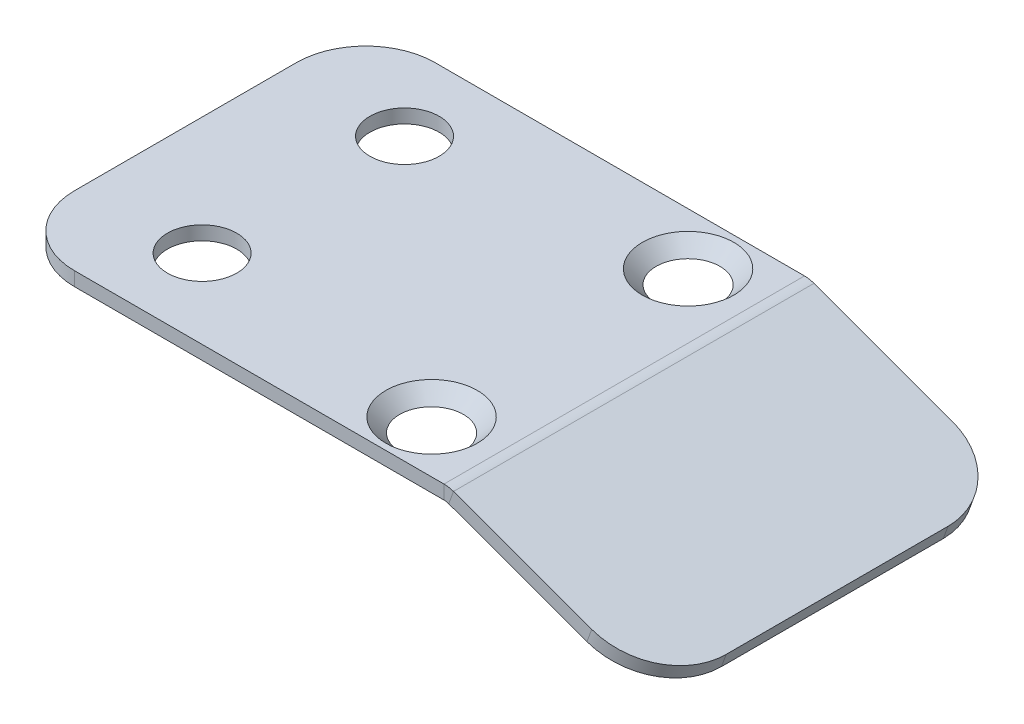
ISO-10303-21;
HEADER;
FILE_DESCRIPTION(('STEP AP214'),'2;1');
FILE_NAME('part.step','',(''),(''),'','','');
FILE_SCHEMA(('AUTOMOTIVE_DESIGN { 1 0 10303 214 1 1 1 1 }'));
ENDSEC;
DATA;
#1=APPLICATION_CONTEXT('core data for automotive mechanical design processes');
#2=APPLICATION_PROTOCOL_DEFINITION('international standard','automotive_design',2000,#1);
#3=PRODUCT_CONTEXT('',#1,'mechanical');
#4=PRODUCT('Part','Part','',(#3));
#5=PRODUCT_RELATED_PRODUCT_CATEGORY('part','',(#4));
#6=PRODUCT_DEFINITION_FORMATION('','',#4);
#7=PRODUCT_DEFINITION_CONTEXT('part definition',#1,'design');
#8=PRODUCT_DEFINITION('design','',#6,#7);
#9=PRODUCT_DEFINITION_SHAPE('','',#8);
#10=(LENGTH_UNIT() NAMED_UNIT(*) SI_UNIT(.MILLI.,.METRE.));
#11=(NAMED_UNIT(*) PLANE_ANGLE_UNIT() SI_UNIT($,.RADIAN.));
#12=(NAMED_UNIT(*) SI_UNIT($,.STERADIAN.) SOLID_ANGLE_UNIT());
#13=UNCERTAINTY_MEASURE_WITH_UNIT(LENGTH_MEASURE(1.E-05),#10,'distance_accuracy_value','');
#14=(GEOMETRIC_REPRESENTATION_CONTEXT(3) GLOBAL_UNCERTAINTY_ASSIGNED_CONTEXT((#13)) GLOBAL_UNIT_ASSIGNED_CONTEXT((#10,
#11,#12)) REPRESENTATION_CONTEXT('',''));
#15=CARTESIAN_POINT('',(0.,0.,0.));
#16=DIRECTION('',(0.,0.,1.));
#17=DIRECTION('',(1.,0.,0.));
#18=AXIS2_PLACEMENT_3D('',#15,#16,#17);
#19=CARTESIAN_POINT('',(16.3313863252344,-0.120614758428185,13.));
#20=DIRECTION('',(0.,0.,1.));
#21=DIRECTION('',(1.,0.,0.));
#22=AXIS2_PLACEMENT_3D('',#19,#20,#21);
#23=PLANE('',#22);
#24=DIRECTION('',(-0.342020143325669,-0.939692620785908,0.));
#25=VECTOR('',#24,1.);
#26=CARTESIAN_POINT('',(16.3313863252344,-0.120614758428185,13.));
#27=LINE('',#26,#25);
#28=CARTESIAN_POINT('',(16.3313863252344,-0.120614758428185,13.));
#29=VERTEX_POINT('',#28);
#30=CARTESIAN_POINT('',(15.9893661819087,-1.06030737921409,13.));
#31=VERTEX_POINT('',#30);
#32=EDGE_CURVE('E129',#29,#31,#27,.T.);
#33=ORIENTED_EDGE('',*,*,#32,.F.);
#34=CARTESIAN_POINT('',(15.6473460385831,-2.,13.));
#35=DIRECTION('',(0.,0.,1.));
#36=DIRECTION('',(1.,0.,0.));
#37=AXIS2_PLACEMENT_3D('',#34,#35,#36);
#38=CIRCLE('',#37,2.);
#39=CARTESIAN_POINT('',(15.6473460385831,0.,13.));
#40=VERTEX_POINT('',#39);
#41=EDGE_CURVE('E133',#40,#29,#38,.F.);
#42=ORIENTED_EDGE('',*,*,#41,.F.);
#43=DIRECTION('',(0.,1.,0.));
#44=VECTOR('',#43,1.);
#45=CARTESIAN_POINT('',(15.6473460385831,-1.,13.));
#46=LINE('',#45,#44);
#47=CARTESIAN_POINT('',(15.6473460385831,-1.,13.));
#48=VERTEX_POINT('',#47);
#49=EDGE_CURVE('E138',#48,#40,#46,.T.);
#50=ORIENTED_EDGE('',*,*,#49,.F.);
#51=CARTESIAN_POINT('',(15.6473460385831,-2.,13.));
#52=DIRECTION('',(0.,0.,1.));
#53=DIRECTION('',(1.,0.,0.));
#54=AXIS2_PLACEMENT_3D('',#51,#52,#53);
#55=CIRCLE('',#54,1.);
#56=EDGE_CURVE('E135',#48,#31,#55,.F.);
#57=ORIENTED_EDGE('',*,*,#56,.T.);
#58=EDGE_LOOP('',(#33,#42,#50,#57));
#59=FACE_BOUND('',#58,.T.);
#60=ADVANCED_FACE('F38',(#59),#23,.T.);
#61=CARTESIAN_POINT('',(15.6473460385831,-1.,13.));
#62=DIRECTION('',(0.,0.,1.));
#63=DIRECTION('',(1.,0.,0.));
#64=AXIS2_PLACEMENT_3D('',#61,#62,#63);
#65=PLANE('',#64);
#66=DIRECTION('',(0.939692620785908,-0.342020143325669,0.));
#67=VECTOR('',#66,1.);
#68=CARTESIAN_POINT('',(15.6579798566743,-0.939692620785908,13.));
#69=LINE('',#68,#67);
#70=CARTESIAN_POINT('',(25.9595167527448,-4.68914541815061,13.));
#71=VERTEX_POINT('',#70);
#72=EDGE_CURVE('E156',#31,#71,#69,.T.);
#73=ORIENTED_EDGE('',*,*,#72,.T.);
#74=DIRECTION('',(-0.342020143325665,-0.93969262078591,0.));
#75=VECTOR('',#74,1.);
#76=CARTESIAN_POINT('',(25.9388904142624,-4.74581581737699,13.));
#77=LINE('',#76,#75);
#78=CARTESIAN_POINT('',(26.3015368960705,-3.7494527973647,13.));
#79=VERTEX_POINT('',#78);
#80=EDGE_CURVE('E11',#71,#79,#77,.F.);
#81=ORIENTED_EDGE('',*,*,#80,.T.);
#82=DIRECTION('',(0.939692620785908,-0.342020143325669,0.));
#83=VECTOR('',#82,1.);
#84=CARTESIAN_POINT('',(16.,0.,13.));
#85=LINE('',#84,#83);
#86=EDGE_CURVE('E145',#29,#79,#85,.T.);
#87=ORIENTED_EDGE('',*,*,#86,.F.);
#88=ORIENTED_EDGE('',*,*,#32,.T.);
#89=EDGE_LOOP('',(#73,#81,#87,#88));
#90=FACE_BOUND('',#89,.T.);
#91=ADVANCED_FACE('F155',(#90),#65,.T.);
#92=CARTESIAN_POINT('',(15.6473460385831,0.,-13.));
#93=DIRECTION('',(0.,0.,-1.));
#94=DIRECTION('',(-1.,0.,0.));
#95=AXIS2_PLACEMENT_3D('',#92,#93,#94);
#96=PLANE('',#95);
#97=DIRECTION('',(0.,-1.,0.));
#98=VECTOR('',#97,1.);
#99=CARTESIAN_POINT('',(15.6473460385831,0.,-13.));
#100=LINE('',#99,#98);
#101=CARTESIAN_POINT('',(15.6473460385831,0.,-13.));
#102=VERTEX_POINT('',#101);
#103=CARTESIAN_POINT('',(15.6473460385831,-1.,-13.));
#104=VERTEX_POINT('',#103);
#105=EDGE_CURVE('E201',#102,#104,#100,.T.);
#106=ORIENTED_EDGE('',*,*,#105,.F.);
#107=CARTESIAN_POINT('',(15.6473460385831,-2.,-13.));
#108=DIRECTION('',(0.,0.,1.));
#109=DIRECTION('',(1.,0.,0.));
#110=AXIS2_PLACEMENT_3D('',#107,#108,#109);
#111=CIRCLE('',#110,2.);
#112=CARTESIAN_POINT('',(16.3313863252344,-0.120614758428185,-13.));
#113=VERTEX_POINT('',#112);
#114=EDGE_CURVE('E175',#102,#113,#111,.F.);
#115=ORIENTED_EDGE('',*,*,#114,.T.);
#116=DIRECTION('',(0.342020143325669,0.939692620785908,0.));
#117=VECTOR('',#116,1.);
#118=CARTESIAN_POINT('',(15.9893661819087,-1.06030737921409,-13.));
#119=LINE('',#118,#117);
#120=CARTESIAN_POINT('',(15.9893661819087,-1.06030737921409,-13.));
#121=VERTEX_POINT('',#120);
#122=EDGE_CURVE('E199',#121,#113,#119,.T.);
#123=ORIENTED_EDGE('',*,*,#122,.F.);
#124=CARTESIAN_POINT('',(15.6473460385831,-2.,-13.));
#125=DIRECTION('',(0.,0.,1.));
#126=DIRECTION('',(1.,0.,0.));
#127=AXIS2_PLACEMENT_3D('',#124,#125,#126);
#128=CIRCLE('',#127,1.);
#129=EDGE_CURVE('E181',#104,#121,#128,.F.);
#130=ORIENTED_EDGE('',*,*,#129,.F.);
#131=EDGE_LOOP('',(#106,#115,#123,#130));
#132=FACE_BOUND('',#131,.T.);
#133=ADVANCED_FACE('F296',(#132),#96,.T.);
#134=CARTESIAN_POINT('',(15.9893661819087,-1.06030737921409,-13.));
#135=DIRECTION('',(0.,0.,-1.));
#136=DIRECTION('',(-1.,0.,0.));
#137=AXIS2_PLACEMENT_3D('',#134,#135,#136);
#138=PLANE('',#137);
#139=DIRECTION('',(1.,0.,0.));
#140=VECTOR('',#139,1.);
#141=CARTESIAN_POINT('',(-16.,-1.,-13.));
#142=LINE('',#141,#140);
#143=CARTESIAN_POINT('',(-11.,-1.,-13.));
#144=VERTEX_POINT('',#143);
#145=EDGE_CURVE('E179',#144,#104,#142,.T.);
#146=ORIENTED_EDGE('',*,*,#145,.F.);
#147=DIRECTION('',(0.,1.,0.));
#148=VECTOR('',#147,1.);
#149=CARTESIAN_POINT('',(-11.,-1.06030737921409,-13.));
#150=LINE('',#149,#148);
#151=CARTESIAN_POINT('',(-11.,0.,-13.));
#152=VERTEX_POINT('',#151);
#153=EDGE_CURVE('E137',#144,#152,#150,.T.);
#154=ORIENTED_EDGE('',*,*,#153,.T.);
#155=DIRECTION('',(1.,0.,0.));
#156=VECTOR('',#155,1.);
#157=CARTESIAN_POINT('',(-16.,0.,-13.));
#158=LINE('',#157,#156);
#159=EDGE_CURVE('E177',#152,#102,#158,.T.);
#160=ORIENTED_EDGE('',*,*,#159,.T.);
#161=ORIENTED_EDGE('',*,*,#105,.T.);
#162=EDGE_LOOP('',(#146,#154,#160,#161));
#163=FACE_BOUND('',#162,.T.);
#164=ADVANCED_FACE('F292',(#163),#138,.T.);
#165=CARTESIAN_POINT('',(15.6579798566743,-0.939692620785908,13.));
#166=DIRECTION('',(0.342020143325669,0.939692620785908,0.));
#167=DIRECTION('',(-0.939692620785908,0.342020143325669,0.));
#168=AXIS2_PLACEMENT_3D('',#165,#166,#167);
#169=PLANE('',#168);
#170=DIRECTION('',(0.939692620785908,-0.342020143325669,0.));
#171=VECTOR('',#170,1.);
#172=CARTESIAN_POINT('',(15.6579798566743,-0.939692620785908,-13.));
#173=LINE('',#172,#171);
#174=CARTESIAN_POINT('',(25.9595167527448,-4.68914541815061,-13.));
#175=VERTEX_POINT('',#174);
#176=EDGE_CURVE('E170',#121,#175,#173,.T.);
#177=ORIENTED_EDGE('',*,*,#176,.T.);
#178=CARTESIAN_POINT('',(25.9595167527448,-4.68914541815061,-8.));
#179=DIRECTION('',(0.342020143325669,0.939692620785908,0.));
#180=DIRECTION('',(-0.939692620785908,0.342020143325669,0.));
#181=AXIS2_PLACEMENT_3D('',#178,#179,#180);
#182=CIRCLE('',#181,5.);
#183=CARTESIAN_POINT('',(30.6579798566743,-6.39924613477896,-7.99999999999999));
#184=VERTEX_POINT('',#183);
#185=EDGE_CURVE('E228',#175,#184,#182,.F.);
#186=ORIENTED_EDGE('',*,*,#185,.T.);
#187=DIRECTION('',(0.,0.,-1.));
#188=VECTOR('',#187,1.);
#189=CARTESIAN_POINT('',(30.6579798566743,-6.39924613477896,13.));
#190=LINE('',#189,#188);
#191=CARTESIAN_POINT('',(30.6579798566743,-6.39924613477896,8.));
#192=VERTEX_POINT('',#191);
#193=EDGE_CURVE('E197',#192,#184,#190,.T.);
#194=ORIENTED_EDGE('',*,*,#193,.F.);
#195=CARTESIAN_POINT('',(25.9595167527448,-4.68914541815061,8.));
#196=DIRECTION('',(0.342020143325669,0.939692620785908,0.));
#197=DIRECTION('',(-0.939692620785908,0.342020143325669,0.));
#198=AXIS2_PLACEMENT_3D('',#195,#196,#197);
#199=CIRCLE('',#198,5.);
#200=EDGE_CURVE('E226',#192,#71,#199,.F.);
#201=ORIENTED_EDGE('',*,*,#200,.T.);
#202=ORIENTED_EDGE('',*,*,#72,.F.);
#203=DIRECTION('',(0.,0.,-1.));
#204=VECTOR('',#203,1.);
#205=CARTESIAN_POINT('',(15.9893661819087,-1.06030737921409,13.));
#206=LINE('',#205,#204);
#207=EDGE_CURVE('E169',#31,#121,#206,.T.);
#208=ORIENTED_EDGE('',*,*,#207,.T.);
#209=EDGE_LOOP('',(#177,#186,#194,#201,#202,#208));
#210=FACE_BOUND('',#209,.T.);
#211=ADVANCED_FACE('F244',(#210),#169,.F.);
#212=CARTESIAN_POINT('',(31.,-5.45955351399305,13.));
#213=DIRECTION('',(0.93969262078591,-0.342020143325665,0.));
#214=DIRECTION('',(0.342020143325665,0.93969262078591,0.));
#215=AXIS2_PLACEMENT_3D('',#212,#213,#214);
#216=PLANE('',#215);
#217=ORIENTED_EDGE('',*,*,#193,.T.);
#218=DIRECTION('',(-0.342020143325665,-0.93969262078591,0.));
#219=VECTOR('',#218,1.);
#220=CARTESIAN_POINT('',(31.,-5.45955351399305,-8.));
#221=LINE('',#220,#219);
#222=CARTESIAN_POINT('',(31.,-5.45955351399305,-7.99999999999999));
#223=VERTEX_POINT('',#222);
#224=EDGE_CURVE('E59',#184,#223,#221,.F.);
#225=ORIENTED_EDGE('',*,*,#224,.T.);
#226=DIRECTION('',(0.,0.,-1.));
#227=VECTOR('',#226,1.);
#228=CARTESIAN_POINT('',(31.,-5.45955351399305,13.));
#229=LINE('',#228,#227);
#230=CARTESIAN_POINT('',(31.,-5.45955351399305,8.));
#231=VERTEX_POINT('',#230);
#232=EDGE_CURVE('E152',#231,#223,#229,.T.);
#233=ORIENTED_EDGE('',*,*,#232,.F.);
#234=DIRECTION('',(-0.342020143325665,-0.93969262078591,0.));
#235=VECTOR('',#234,1.);
#236=CARTESIAN_POINT('',(31.,-5.45955351399305,8.));
#237=LINE('',#236,#235);
#238=EDGE_CURVE('E230',#231,#192,#237,.T.);
#239=ORIENTED_EDGE('',*,*,#238,.T.);
#240=EDGE_LOOP('',(#217,#225,#233,#239));
#241=FACE_BOUND('',#240,.T.);
#242=ADVANCED_FACE('F245',(#241),#216,.T.);
#243=CARTESIAN_POINT('',(16.,0.,13.));
#244=DIRECTION('',(0.342020143325669,0.939692620785908,0.));
#245=DIRECTION('',(-0.939692620785908,0.342020143325669,0.));
#246=AXIS2_PLACEMENT_3D('',#243,#244,#245);
#247=PLANE('',#246);
#248=ORIENTED_EDGE('',*,*,#232,.T.);
#249=CARTESIAN_POINT('',(26.3015368960705,-3.7494527973647,-8.));
#250=DIRECTION('',(0.342020143325669,0.939692620785908,0.));
#251=DIRECTION('',(-0.939692620785908,0.342020143325669,0.));
#252=AXIS2_PLACEMENT_3D('',#249,#250,#251);
#253=CIRCLE('',#252,5.);
#254=CARTESIAN_POINT('',(26.3015368960705,-3.7494527973647,-13.));
#255=VERTEX_POINT('',#254);
#256=EDGE_CURVE('E46',#223,#255,#253,.T.);
#257=ORIENTED_EDGE('',*,*,#256,.T.);
#258=DIRECTION('',(0.939692620785908,-0.342020143325669,0.));
#259=VECTOR('',#258,1.);
#260=CARTESIAN_POINT('',(16.,0.,-13.));
#261=LINE('',#260,#259);
#262=EDGE_CURVE('E148',#113,#255,#261,.T.);
#263=ORIENTED_EDGE('',*,*,#262,.F.);
#264=DIRECTION('',(0.,0.,-1.));
#265=VECTOR('',#264,1.);
#266=CARTESIAN_POINT('',(16.3313863252344,-0.120614758428185,13.));
#267=LINE('',#266,#265);
#268=EDGE_CURVE('E143',#29,#113,#267,.T.);
#269=ORIENTED_EDGE('',*,*,#268,.F.);
#270=ORIENTED_EDGE('',*,*,#86,.T.);
#271=CARTESIAN_POINT('',(26.3015368960705,-3.7494527973647,8.));
#272=DIRECTION('',(0.342020143325669,0.939692620785908,0.));
#273=DIRECTION('',(-0.939692620785908,0.342020143325669,0.));
#274=AXIS2_PLACEMENT_3D('',#271,#272,#273);
#275=CIRCLE('',#274,5.);
#276=EDGE_CURVE('E234',#79,#231,#275,.T.);
#277=ORIENTED_EDGE('',*,*,#276,.T.);
#278=EDGE_LOOP('',(#248,#257,#263,#269,#270,#277));
#279=FACE_BOUND('',#278,.T.);
#280=ADVANCED_FACE('F144',(#279),#247,.T.);
#281=CARTESIAN_POINT('',(15.6473460385831,-2.,13.));
#282=DIRECTION('',(0.,0.,-1.));
#283=DIRECTION('',(-1.,0.,0.));
#284=AXIS2_PLACEMENT_3D('',#281,#282,#283);
#285=CYLINDRICAL_SURFACE('',#284,2.);
#286=ORIENTED_EDGE('',*,*,#114,.F.);
#287=DIRECTION('',(0.,0.,-1.));
#288=VECTOR('',#287,1.);
#289=CARTESIAN_POINT('',(15.6473460385831,0.,13.));
#290=LINE('',#289,#288);
#291=EDGE_CURVE('E153',#40,#102,#290,.T.);
#292=ORIENTED_EDGE('',*,*,#291,.F.);
#293=ORIENTED_EDGE('',*,*,#41,.T.);
#294=ORIENTED_EDGE('',*,*,#268,.T.);
#295=EDGE_LOOP('',(#286,#292,#293,#294));
#296=FACE_BOUND('',#295,.T.);
#297=ADVANCED_FACE('F159',(#296),#285,.T.);
#298=CARTESIAN_POINT('',(-16.,0.,13.));
#299=DIRECTION('',(0.,1.,0.));
#300=DIRECTION('',(0.,0.,1.));
#301=AXIS2_PLACEMENT_3D('',#298,#299,#300);
#302=PLANE('',#301);
#303=CARTESIAN_POINT('',(-7.5,0.,7.3));
#304=DIRECTION('',(0.,1.,0.));
#305=DIRECTION('',(0.,0.,1.));
#306=AXIS2_PLACEMENT_3D('',#303,#304,#305);
#307=CIRCLE('',#306,2.5);
#308=CARTESIAN_POINT('',(-7.5,0.,9.8));
#309=VERTEX_POINT('',#308);
#310=EDGE_CURVE('E270',#309,#309,#307,.T.);
#311=ORIENTED_EDGE('',*,*,#310,.F.);
#312=EDGE_LOOP('',(#311));
#313=FACE_BOUND('',#312,.T.);
#314=CARTESIAN_POINT('',(-7.5,0.,-7.3));
#315=DIRECTION('',(0.,1.,0.));
#316=DIRECTION('',(0.,0.,1.));
#317=AXIS2_PLACEMENT_3D('',#314,#315,#316);
#318=CIRCLE('',#317,2.5);
#319=CARTESIAN_POINT('',(-7.5,0.,-4.8));
#320=VERTEX_POINT('',#319);
#321=EDGE_CURVE('E264',#320,#320,#318,.T.);
#322=ORIENTED_EDGE('',*,*,#321,.F.);
#323=EDGE_LOOP('',(#322));
#324=FACE_BOUND('',#323,.T.);
#325=CARTESIAN_POINT('',(11.,0.,9.25));
#326=DIRECTION('',(0.,1.,0.));
#327=DIRECTION('',(0.,0.,1.));
#328=AXIS2_PLACEMENT_3D('',#325,#326,#327);
#329=CIRCLE('',#328,3.3);
#330=CARTESIAN_POINT('',(11.,0.,12.55));
#331=VERTEX_POINT('',#330);
#332=EDGE_CURVE('E258',#331,#331,#329,.T.);
#333=ORIENTED_EDGE('',*,*,#332,.F.);
#334=EDGE_LOOP('',(#333));
#335=FACE_BOUND('',#334,.T.);
#336=CARTESIAN_POINT('',(11.,0.,-9.25));
#337=DIRECTION('',(0.,1.,0.));
#338=DIRECTION('',(0.,0.,1.));
#339=AXIS2_PLACEMENT_3D('',#336,#337,#338);
#340=CIRCLE('',#339,3.3);
#341=CARTESIAN_POINT('',(11.,0.,-5.95));
#342=VERTEX_POINT('',#341);
#343=EDGE_CURVE('E252',#342,#342,#340,.T.);
#344=ORIENTED_EDGE('',*,*,#343,.F.);
#345=EDGE_LOOP('',(#344));
#346=FACE_BOUND('',#345,.T.);
#347=ORIENTED_EDGE('',*,*,#159,.F.);
#348=CARTESIAN_POINT('',(-11.,0.,-8.));
#349=DIRECTION('',(0.,1.,0.));
#350=DIRECTION('',(0.,0.,1.));
#351=AXIS2_PLACEMENT_3D('',#348,#349,#350);
#352=CIRCLE('',#351,5.);
#353=CARTESIAN_POINT('',(-16.,0.,-7.99999999999999));
#354=VERTEX_POINT('',#353);
#355=EDGE_CURVE('E210',#152,#354,#352,.T.);
#356=ORIENTED_EDGE('',*,*,#355,.T.);
#357=DIRECTION('',(0.,0.,-1.));
#358=VECTOR('',#357,1.);
#359=CARTESIAN_POINT('',(-16.,0.,13.));
#360=LINE('',#359,#358);
#361=CARTESIAN_POINT('',(-16.,0.,8.));
#362=VERTEX_POINT('',#361);
#363=EDGE_CURVE('E192',#362,#354,#360,.T.);
#364=ORIENTED_EDGE('',*,*,#363,.F.);
#365=CARTESIAN_POINT('',(-11.,0.,8.));
#366=DIRECTION('',(0.,1.,0.));
#367=DIRECTION('',(0.,0.,1.));
#368=AXIS2_PLACEMENT_3D('',#365,#366,#367);
#369=CIRCLE('',#368,5.);
#370=CARTESIAN_POINT('',(-11.,0.,13.));
#371=VERTEX_POINT('',#370);
#372=EDGE_CURVE('E208',#362,#371,#369,.T.);
#373=ORIENTED_EDGE('',*,*,#372,.T.);
#374=DIRECTION('',(1.,0.,0.));
#375=VECTOR('',#374,1.);
#376=CARTESIAN_POINT('',(-16.,0.,13.));
#377=LINE('',#376,#375);
#378=EDGE_CURVE('E161',#371,#40,#377,.T.);
#379=ORIENTED_EDGE('',*,*,#378,.T.);
#380=ORIENTED_EDGE('',*,*,#291,.T.);
#381=EDGE_LOOP('',(#347,#356,#364,#373,#379,#380));
#382=FACE_BOUND('',#381,.T.);
#383=ADVANCED_FACE('F276',(#313,#324,#335,#346,#382),#302,.T.);
#384=CARTESIAN_POINT('',(-16.,-1.,13.));
#385=DIRECTION('',(-1.,0.,0.));
#386=DIRECTION('',(0.,0.,1.));
#387=AXIS2_PLACEMENT_3D('',#384,#385,#386);
#388=PLANE('',#387);
#389=ORIENTED_EDGE('',*,*,#363,.T.);
#390=DIRECTION('',(0.,1.,0.));
#391=VECTOR('',#390,1.);
#392=CARTESIAN_POINT('',(-16.,-1.,-8.));
#393=LINE('',#392,#391);
#394=CARTESIAN_POINT('',(-16.,-1.,-7.99999999999999));
#395=VERTEX_POINT('',#394);
#396=EDGE_CURVE('E215',#354,#395,#393,.F.);
#397=ORIENTED_EDGE('',*,*,#396,.T.);
#398=DIRECTION('',(0.,0.,-1.));
#399=VECTOR('',#398,1.);
#400=CARTESIAN_POINT('',(-16.,-1.,13.));
#401=LINE('',#400,#399);
#402=CARTESIAN_POINT('',(-16.,-1.,8.));
#403=VERTEX_POINT('',#402);
#404=EDGE_CURVE('E189',#403,#395,#401,.T.);
#405=ORIENTED_EDGE('',*,*,#404,.F.);
#406=DIRECTION('',(0.,1.,0.));
#407=VECTOR('',#406,1.);
#408=CARTESIAN_POINT('',(-16.,-1.,8.));
#409=LINE('',#408,#407);
#410=EDGE_CURVE('E212',#403,#362,#409,.T.);
#411=ORIENTED_EDGE('',*,*,#410,.T.);
#412=EDGE_LOOP('',(#389,#397,#405,#411));
#413=FACE_BOUND('',#412,.T.);
#414=ADVANCED_FACE('F279',(#413),#388,.T.);
#415=CARTESIAN_POINT('',(-16.,-1.,13.));
#416=DIRECTION('',(0.,1.,0.));
#417=DIRECTION('',(0.,0.,1.));
#418=AXIS2_PLACEMENT_3D('',#415,#416,#417);
#419=PLANE('',#418);
#420=CARTESIAN_POINT('',(-7.5,-1.,7.3));
#421=DIRECTION('',(0.,1.,0.));
#422=DIRECTION('',(0.,0.,1.));
#423=AXIS2_PLACEMENT_3D('',#420,#421,#422);
#424=CIRCLE('',#423,2.5);
#425=CARTESIAN_POINT('',(-7.5,-1.,9.8));
#426=VERTEX_POINT('',#425);
#427=EDGE_CURVE('E267',#426,#426,#424,.T.);
#428=ORIENTED_EDGE('',*,*,#427,.T.);
#429=EDGE_LOOP('',(#428));
#430=FACE_BOUND('',#429,.T.);
#431=CARTESIAN_POINT('',(-7.5,-1.,-7.3));
#432=DIRECTION('',(0.,1.,0.));
#433=DIRECTION('',(0.,0.,1.));
#434=AXIS2_PLACEMENT_3D('',#431,#432,#433);
#435=CIRCLE('',#434,2.5);
#436=CARTESIAN_POINT('',(-7.5,-1.,-4.8));
#437=VERTEX_POINT('',#436);
#438=EDGE_CURVE('E261',#437,#437,#435,.T.);
#439=ORIENTED_EDGE('',*,*,#438,.T.);
#440=EDGE_LOOP('',(#439));
#441=FACE_BOUND('',#440,.T.);
#442=CARTESIAN_POINT('',(11.,-1.,9.25));
#443=DIRECTION('',(0.,1.,0.));
#444=DIRECTION('',(0.,0.,1.));
#445=AXIS2_PLACEMENT_3D('',#442,#443,#444);
#446=CIRCLE('',#445,2.3);
#447=CARTESIAN_POINT('',(11.,-1.,11.55));
#448=VERTEX_POINT('',#447);
#449=EDGE_CURVE('E255',#448,#448,#446,.T.);
#450=ORIENTED_EDGE('',*,*,#449,.T.);
#451=EDGE_LOOP('',(#450));
#452=FACE_BOUND('',#451,.T.);
#453=CARTESIAN_POINT('',(11.,-1.,-9.25));
#454=DIRECTION('',(0.,1.,0.));
#455=DIRECTION('',(0.,0.,1.));
#456=AXIS2_PLACEMENT_3D('',#453,#454,#455);
#457=CIRCLE('',#456,2.3);
#458=CARTESIAN_POINT('',(11.,-1.,-6.95));
#459=VERTEX_POINT('',#458);
#460=EDGE_CURVE('E173',#459,#459,#457,.T.);
#461=ORIENTED_EDGE('',*,*,#460,.T.);
#462=EDGE_LOOP('',(#461));
#463=FACE_BOUND('',#462,.T.);
#464=ORIENTED_EDGE('',*,*,#404,.T.);
#465=CARTESIAN_POINT('',(-11.,-1.,-8.));
#466=DIRECTION('',(0.,1.,0.));
#467=DIRECTION('',(0.,0.,1.));
#468=AXIS2_PLACEMENT_3D('',#465,#466,#467);
#469=CIRCLE('',#468,5.);
#470=EDGE_CURVE('E219',#395,#144,#469,.F.);
#471=ORIENTED_EDGE('',*,*,#470,.T.);
#472=ORIENTED_EDGE('',*,*,#145,.T.);
#473=DIRECTION('',(0.,0.,-1.));
#474=VECTOR('',#473,1.);
#475=CARTESIAN_POINT('',(15.6473460385831,-1.,13.));
#476=LINE('',#475,#474);
#477=EDGE_CURVE('E186',#48,#104,#476,.T.);
#478=ORIENTED_EDGE('',*,*,#477,.F.);
#479=DIRECTION('',(1.,0.,0.));
#480=VECTOR('',#479,1.);
#481=CARTESIAN_POINT('',(-16.,-1.,13.));
#482=LINE('',#481,#480);
#483=CARTESIAN_POINT('',(-11.,-1.,13.));
#484=VERTEX_POINT('',#483);
#485=EDGE_CURVE('E163',#484,#48,#482,.T.);
#486=ORIENTED_EDGE('',*,*,#485,.F.);
#487=CARTESIAN_POINT('',(-11.,-1.,8.));
#488=DIRECTION('',(0.,1.,0.));
#489=DIRECTION('',(0.,0.,1.));
#490=AXIS2_PLACEMENT_3D('',#487,#488,#489);
#491=CIRCLE('',#490,5.);
#492=EDGE_CURVE('E217',#484,#403,#491,.F.);
#493=ORIENTED_EDGE('',*,*,#492,.T.);
#494=EDGE_LOOP('',(#464,#471,#472,#478,#486,#493));
#495=FACE_BOUND('',#494,.T.);
#496=ADVANCED_FACE('F302',(#430,#441,#452,#463,#495),#419,.F.);
#497=CARTESIAN_POINT('',(15.6473460385831,-2.,13.));
#498=DIRECTION('',(0.,0.,-1.));
#499=DIRECTION('',(-1.,0.,0.));
#500=AXIS2_PLACEMENT_3D('',#497,#498,#499);
#501=CYLINDRICAL_SURFACE('',#500,1.);
#502=ORIENTED_EDGE('',*,*,#129,.T.);
#503=ORIENTED_EDGE('',*,*,#207,.F.);
#504=ORIENTED_EDGE('',*,*,#56,.F.);
#505=ORIENTED_EDGE('',*,*,#477,.T.);
#506=EDGE_LOOP('',(#502,#503,#504,#505));
#507=FACE_BOUND('',#506,.T.);
#508=ADVANCED_FACE('F298',(#507),#501,.F.);
#509=CARTESIAN_POINT('',(15.6473460385831,-2.,13.));
#510=DIRECTION('',(0.,0.,1.));
#511=DIRECTION('',(1.,0.,0.));
#512=AXIS2_PLACEMENT_3D('',#509,#510,#511);
#513=PLANE('',#512);
#514=ORIENTED_EDGE('',*,*,#378,.F.);
#515=DIRECTION('',(0.,1.,0.));
#516=VECTOR('',#515,1.);
#517=CARTESIAN_POINT('',(-11.,-2.,13.));
#518=LINE('',#517,#516);
#519=EDGE_CURVE('E221',#371,#484,#518,.F.);
#520=ORIENTED_EDGE('',*,*,#519,.T.);
#521=ORIENTED_EDGE('',*,*,#485,.T.);
#522=ORIENTED_EDGE('',*,*,#49,.T.);
#523=EDGE_LOOP('',(#514,#520,#521,#522));
#524=FACE_BOUND('',#523,.T.);
#525=ADVANCED_FACE('F316',(#524),#513,.T.);
#526=CARTESIAN_POINT('',(15.6473460385831,-2.,-13.));
#527=DIRECTION('',(0.,0.,1.));
#528=DIRECTION('',(1.,0.,0.));
#529=AXIS2_PLACEMENT_3D('',#526,#527,#528);
#530=PLANE('',#529);
#531=ORIENTED_EDGE('',*,*,#262,.T.);
#532=DIRECTION('',(-0.342020143325665,-0.93969262078591,0.));
#533=VECTOR('',#532,1.);
#534=CARTESIAN_POINT('',(25.9595167527448,-4.68914541815063,-13.));
#535=LINE('',#534,#533);
#536=EDGE_CURVE('E223',#255,#175,#535,.T.);
#537=ORIENTED_EDGE('',*,*,#536,.T.);
#538=ORIENTED_EDGE('',*,*,#176,.F.);
#539=ORIENTED_EDGE('',*,*,#122,.T.);
#540=EDGE_LOOP('',(#531,#537,#538,#539));
#541=FACE_BOUND('',#540,.T.);
#542=ADVANCED_FACE('F239',(#541),#530,.F.);
#543=CARTESIAN_POINT('',(11.,0.,-9.25));
#544=DIRECTION('',(0.,1.,0.));
#545=DIRECTION('',(0.,0.,1.));
#546=AXIS2_PLACEMENT_3D('',#543,#544,#545);
#547=CONICAL_SURFACE('',#546,3.3,0.785398163397449);
#548=ORIENTED_EDGE('',*,*,#460,.F.);
#549=EDGE_LOOP('',(#548));
#550=FACE_BOUND('',#549,.T.);
#551=ORIENTED_EDGE('',*,*,#343,.T.);
#552=EDGE_LOOP('',(#551));
#553=FACE_BOUND('',#552,.T.);
#554=ADVANCED_FACE('F323',(#550,#553),#547,.F.);
#555=CARTESIAN_POINT('',(11.,0.,9.25));
#556=DIRECTION('',(0.,1.,0.));
#557=DIRECTION('',(0.,0.,1.));
#558=AXIS2_PLACEMENT_3D('',#555,#556,#557);
#559=CONICAL_SURFACE('',#558,3.3,0.785398163397449);
#560=ORIENTED_EDGE('',*,*,#449,.F.);
#561=EDGE_LOOP('',(#560));
#562=FACE_BOUND('',#561,.T.);
#563=ORIENTED_EDGE('',*,*,#332,.T.);
#564=EDGE_LOOP('',(#563));
#565=FACE_BOUND('',#564,.T.);
#566=ADVANCED_FACE('F468',(#562,#565),#559,.F.);
#567=CARTESIAN_POINT('',(-7.5,0.,-7.3));
#568=DIRECTION('',(0.,1.,0.));
#569=DIRECTION('',(0.,0.,1.));
#570=AXIS2_PLACEMENT_3D('',#567,#568,#569);
#571=CYLINDRICAL_SURFACE('',#570,2.5);
#572=ORIENTED_EDGE('',*,*,#438,.F.);
#573=EDGE_LOOP('',(#572));
#574=FACE_BOUND('',#573,.T.);
#575=ORIENTED_EDGE('',*,*,#321,.T.);
#576=EDGE_LOOP('',(#575));
#577=FACE_BOUND('',#576,.T.);
#578=ADVANCED_FACE('F458',(#574,#577),#571,.F.);
#579=CARTESIAN_POINT('',(-7.5,0.,7.3));
#580=DIRECTION('',(0.,1.,0.));
#581=DIRECTION('',(0.,0.,1.));
#582=AXIS2_PLACEMENT_3D('',#579,#580,#581);
#583=CYLINDRICAL_SURFACE('',#582,2.5);
#584=ORIENTED_EDGE('',*,*,#427,.F.);
#585=EDGE_LOOP('',(#584));
#586=FACE_BOUND('',#585,.T.);
#587=ORIENTED_EDGE('',*,*,#310,.T.);
#588=EDGE_LOOP('',(#587));
#589=FACE_BOUND('',#588,.T.);
#590=ADVANCED_FACE('F274',(#586,#589),#583,.F.);
#591=CARTESIAN_POINT('',(-11.,-1.06030737921409,-8.));
#592=DIRECTION('',(0.,1.,0.));
#593=DIRECTION('',(0.,0.,1.));
#594=AXIS2_PLACEMENT_3D('',#591,#592,#593);
#595=CYLINDRICAL_SURFACE('',#594,5.);
#596=ORIENTED_EDGE('',*,*,#470,.F.);
#597=ORIENTED_EDGE('',*,*,#396,.F.);
#598=ORIENTED_EDGE('',*,*,#355,.F.);
#599=ORIENTED_EDGE('',*,*,#153,.F.);
#600=EDGE_LOOP('',(#596,#597,#598,#599));
#601=FACE_BOUND('',#600,.T.);
#602=ADVANCED_FACE('F306',(#601),#595,.T.);
#603=CARTESIAN_POINT('',(-11.,-1.,8.));
#604=DIRECTION('',(0.,1.,0.));
#605=DIRECTION('',(0.,0.,1.));
#606=AXIS2_PLACEMENT_3D('',#603,#604,#605);
#607=CYLINDRICAL_SURFACE('',#606,5.);
#608=ORIENTED_EDGE('',*,*,#492,.F.);
#609=ORIENTED_EDGE('',*,*,#519,.F.);
#610=ORIENTED_EDGE('',*,*,#372,.F.);
#611=ORIENTED_EDGE('',*,*,#410,.F.);
#612=EDGE_LOOP('',(#608,#609,#610,#611));
#613=FACE_BOUND('',#612,.T.);
#614=ADVANCED_FACE('F313',(#613),#607,.T.);
#615=CARTESIAN_POINT('',(25.6174966094191,-5.62883803893648,-8.));
#616=DIRECTION('',(0.342020143325665,0.93969262078591,0.));
#617=DIRECTION('',(-0.93969262078591,0.342020143325665,0.));
#618=AXIS2_PLACEMENT_3D('',#615,#616,#617);
#619=CYLINDRICAL_SURFACE('',#618,5.);
#620=ORIENTED_EDGE('',*,*,#256,.F.);
#621=ORIENTED_EDGE('',*,*,#224,.F.);
#622=ORIENTED_EDGE('',*,*,#185,.F.);
#623=ORIENTED_EDGE('',*,*,#536,.F.);
#624=EDGE_LOOP('',(#620,#621,#622,#623));
#625=FACE_BOUND('',#624,.T.);
#626=ADVANCED_FACE('F241',(#625),#619,.T.);
#627=CARTESIAN_POINT('',(26.3015368960705,-3.74945279736472,8.));
#628=DIRECTION('',(-0.342020143325665,-0.93969262078591,0.));
#629=DIRECTION('',(0.93969262078591,-0.342020143325665,0.));
#630=AXIS2_PLACEMENT_3D('',#627,#628,#629);
#631=CYLINDRICAL_SURFACE('',#630,5.);
#632=ORIENTED_EDGE('',*,*,#276,.F.);
#633=ORIENTED_EDGE('',*,*,#80,.F.);
#634=ORIENTED_EDGE('',*,*,#200,.F.);
#635=ORIENTED_EDGE('',*,*,#238,.F.);
#636=EDGE_LOOP('',(#632,#633,#634,#635));
#637=FACE_BOUND('',#636,.T.);
#638=ADVANCED_FACE('F40',(#637),#631,.T.);
#639=CLOSED_SHELL('',(#60,#91,#133,#164,#211,#242,#280,#297,#383,#414,#496,#508,#525,#542,#554,
#566,#578,#590,#602,#614,#626,#638));
#640=MANIFOLD_SOLID_BREP('B2',#639);
#641=ADVANCED_BREP_SHAPE_REPRESENTATION('',(#18,#640),#14);
#642=SHAPE_DEFINITION_REPRESENTATION(#9,#641);
ENDSEC;
END-ISO-10303-21;
